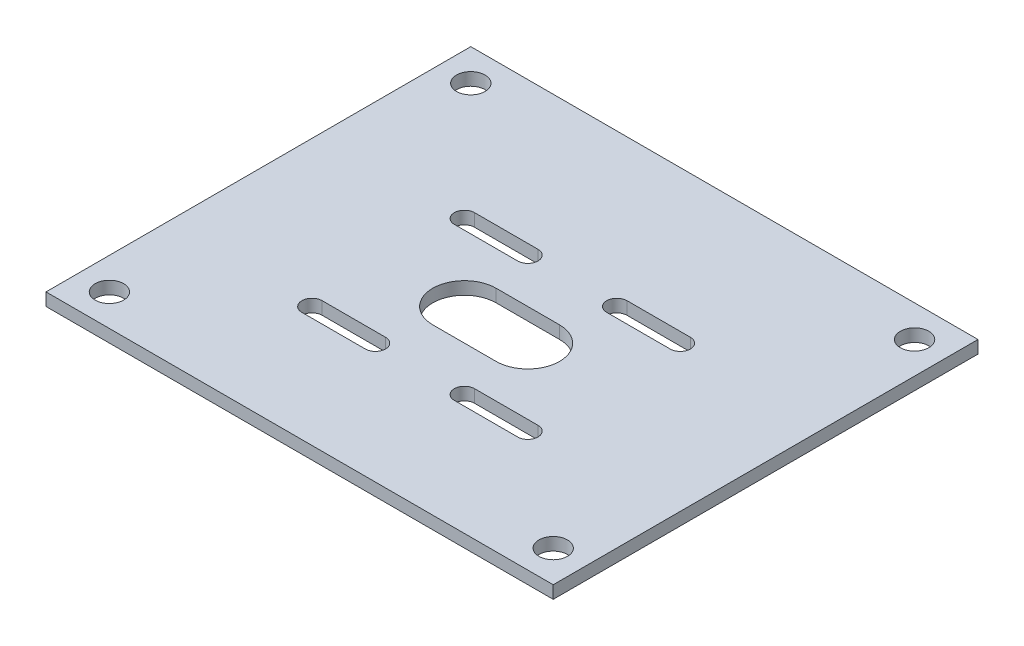
ISO-10303-21;
HEADER;
FILE_DESCRIPTION(('STEP AP214'),'2;1');
FILE_NAME('part.step','',(''),(''),'','','');
FILE_SCHEMA(('AUTOMOTIVE_DESIGN { 1 0 10303 214 1 1 1 1 }'));
ENDSEC;
DATA;
#1=APPLICATION_CONTEXT('core data for automotive mechanical design processes');
#2=APPLICATION_PROTOCOL_DEFINITION('international standard','automotive_design',2000,#1);
#3=PRODUCT_CONTEXT('',#1,'mechanical');
#4=PRODUCT('Part','Part','',(#3));
#5=PRODUCT_RELATED_PRODUCT_CATEGORY('part','',(#4));
#6=PRODUCT_DEFINITION_FORMATION('','',#4);
#7=PRODUCT_DEFINITION_CONTEXT('part definition',#1,'design');
#8=PRODUCT_DEFINITION('design','',#6,#7);
#9=PRODUCT_DEFINITION_SHAPE('','',#8);
#10=(LENGTH_UNIT() NAMED_UNIT(*) SI_UNIT(.MILLI.,.METRE.));
#11=(NAMED_UNIT(*) PLANE_ANGLE_UNIT() SI_UNIT($,.RADIAN.));
#12=(NAMED_UNIT(*) SI_UNIT($,.STERADIAN.) SOLID_ANGLE_UNIT());
#13=UNCERTAINTY_MEASURE_WITH_UNIT(LENGTH_MEASURE(1.E-05),#10,'distance_accuracy_value','');
#14=(GEOMETRIC_REPRESENTATION_CONTEXT(3) GLOBAL_UNCERTAINTY_ASSIGNED_CONTEXT((#13)) GLOBAL_UNIT_ASSIGNED_CONTEXT((#10,
#11,#12)) REPRESENTATION_CONTEXT('',''));
#15=CARTESIAN_POINT('',(0.,0.,0.));
#16=DIRECTION('',(0.,0.,1.));
#17=DIRECTION('',(1.,0.,0.));
#18=AXIS2_PLACEMENT_3D('',#15,#16,#17);
#19=CARTESIAN_POINT('',(0.,2.,0.));
#20=DIRECTION('',(0.,-1.,0.));
#21=DIRECTION('',(0.,0.,-1.));
#22=AXIS2_PLACEMENT_3D('',#19,#20,#21);
#23=PLANE('',#22);
#24=CARTESIAN_POINT('',(-22.0208152801713,2.,12.0208152801713));
#25=DIRECTION('',(0.,1.,0.));
#26=DIRECTION('',(0.,0.,-1.));
#27=AXIS2_PLACEMENT_3D('',#24,#25,#26);
#28=CIRCLE('',#27,1.6);
#29=CARTESIAN_POINT('',(-22.0208152801713,2.,10.4208152801713));
#30=VERTEX_POINT('',#29);
#31=CARTESIAN_POINT('',(-22.0208152801713,2.,13.6208152801713));
#32=VERTEX_POINT('',#31);
#33=EDGE_CURVE('E252',#30,#32,#28,.T.);
#34=ORIENTED_EDGE('',*,*,#33,.F.);
#35=DIRECTION('',(-1.,0.,0.));
#36=VECTOR('',#35,1.);
#37=CARTESIAN_POINT('',(-22.0208152801713,2.,10.4208152801713));
#38=LINE('',#37,#36);
#39=CARTESIAN_POINT('',(-12.0208152801713,2.,10.4208152801713));
#40=VERTEX_POINT('',#39);
#41=EDGE_CURVE('E263',#40,#30,#38,.T.);
#42=ORIENTED_EDGE('',*,*,#41,.F.);
#43=CARTESIAN_POINT('',(-12.0208152801713,2.,12.0208152801713));
#44=DIRECTION('',(0.,1.,0.));
#45=DIRECTION('',(0.,0.,-1.));
#46=AXIS2_PLACEMENT_3D('',#43,#44,#45);
#47=CIRCLE('',#46,1.6);
#48=CARTESIAN_POINT('',(-12.0208152801713,2.,13.6208152801713));
#49=VERTEX_POINT('',#48);
#50=EDGE_CURVE('E259',#49,#40,#47,.T.);
#51=ORIENTED_EDGE('',*,*,#50,.F.);
#52=DIRECTION('',(1.,0.,0.));
#53=VECTOR('',#52,1.);
#54=CARTESIAN_POINT('',(-22.0208152801713,2.,13.6208152801713));
#55=LINE('',#54,#53);
#56=EDGE_CURVE('E255',#32,#49,#55,.T.);
#57=ORIENTED_EDGE('',*,*,#56,.F.);
#58=EDGE_LOOP('',(#34,#42,#51,#57));
#59=FACE_BOUND('',#58,.T.);
#60=CARTESIAN_POINT('',(2.02081528017131,2.,-12.0208152801713));
#61=DIRECTION('',(0.,1.,0.));
#62=DIRECTION('',(0.,0.,1.));
#63=AXIS2_PLACEMENT_3D('',#60,#61,#62);
#64=CIRCLE('',#63,1.6);
#65=CARTESIAN_POINT('',(2.02081528017131,2.,-13.6208152801713));
#66=VERTEX_POINT('',#65);
#67=CARTESIAN_POINT('',(2.02081528017131,2.,-10.4208152801713));
#68=VERTEX_POINT('',#67);
#69=EDGE_CURVE('E338',#66,#68,#64,.T.);
#70=ORIENTED_EDGE('',*,*,#69,.F.);
#71=DIRECTION('',(-1.,0.,0.));
#72=VECTOR('',#71,1.);
#73=CARTESIAN_POINT('',(2.02081528017131,2.,-13.6208152801713));
#74=LINE('',#73,#72);
#75=CARTESIAN_POINT('',(12.0208152801713,2.,-13.6208152801713));
#76=VERTEX_POINT('',#75);
#77=EDGE_CURVE('E349',#76,#66,#74,.T.);
#78=ORIENTED_EDGE('',*,*,#77,.F.);
#79=CARTESIAN_POINT('',(12.0208152801713,2.,-12.0208152801713));
#80=DIRECTION('',(0.,1.,0.));
#81=DIRECTION('',(0.,0.,1.));
#82=AXIS2_PLACEMENT_3D('',#79,#80,#81);
#83=CIRCLE('',#82,1.6);
#84=CARTESIAN_POINT('',(12.0208152801713,2.,-10.4208152801713));
#85=VERTEX_POINT('',#84);
#86=EDGE_CURVE('E345',#85,#76,#83,.T.);
#87=ORIENTED_EDGE('',*,*,#86,.F.);
#88=DIRECTION('',(1.,0.,0.));
#89=VECTOR('',#88,1.);
#90=CARTESIAN_POINT('',(2.02081528017131,2.,-10.4208152801713));
#91=LINE('',#90,#89);
#92=EDGE_CURVE('E341',#68,#85,#91,.T.);
#93=ORIENTED_EDGE('',*,*,#92,.F.);
#94=EDGE_LOOP('',(#70,#78,#87,#93));
#95=FACE_BOUND('',#94,.T.);
#96=CARTESIAN_POINT('',(30.,2.,-31.));
#97=DIRECTION('',(0.,1.,0.));
#98=DIRECTION('',(0.,0.,1.));
#99=AXIS2_PLACEMENT_3D('',#96,#97,#98);
#100=CIRCLE('',#99,2.25);
#101=CARTESIAN_POINT('',(30.,2.,-28.75));
#102=VERTEX_POINT('',#101);
#103=EDGE_CURVE('E424',#102,#102,#100,.T.);
#104=ORIENTED_EDGE('',*,*,#103,.F.);
#105=EDGE_LOOP('',(#104));
#106=FACE_BOUND('',#105,.T.);
#107=CARTESIAN_POINT('',(-40.,2.,-31.));
#108=DIRECTION('',(0.,1.,0.));
#109=DIRECTION('',(0.,0.,1.));
#110=AXIS2_PLACEMENT_3D('',#107,#108,#109);
#111=CIRCLE('',#110,2.25);
#112=CARTESIAN_POINT('',(-40.,2.,-28.75));
#113=VERTEX_POINT('',#112);
#114=EDGE_CURVE('E432',#113,#113,#111,.T.);
#115=ORIENTED_EDGE('',*,*,#114,.F.);
#116=EDGE_LOOP('',(#115));
#117=FACE_BOUND('',#116,.T.);
#118=DIRECTION('',(0.,0.,1.));
#119=VECTOR('',#118,1.);
#120=CARTESIAN_POINT('',(-45.,2.,31.));
#121=LINE('',#120,#119);
#122=CARTESIAN_POINT('',(-45.,2.,-36.));
#123=VERTEX_POINT('',#122);
#124=CARTESIAN_POINT('',(-45.,2.,31.));
#125=VERTEX_POINT('',#124);
#126=EDGE_CURVE('E440',#123,#125,#121,.T.);
#127=ORIENTED_EDGE('',*,*,#126,.T.);
#128=DIRECTION('',(1.,0.,0.));
#129=VECTOR('',#128,1.);
#130=CARTESIAN_POINT('',(35.,2.,31.));
#131=LINE('',#130,#129);
#132=CARTESIAN_POINT('',(35.,2.,31.));
#133=VERTEX_POINT('',#132);
#134=EDGE_CURVE('E444',#125,#133,#131,.T.);
#135=ORIENTED_EDGE('',*,*,#134,.T.);
#136=DIRECTION('',(0.,0.,-1.));
#137=VECTOR('',#136,1.);
#138=CARTESIAN_POINT('',(35.,2.,-36.));
#139=LINE('',#138,#137);
#140=CARTESIAN_POINT('',(35.,2.,-36.));
#141=VERTEX_POINT('',#140);
#142=EDGE_CURVE('E448',#133,#141,#139,.T.);
#143=ORIENTED_EDGE('',*,*,#142,.T.);
#144=DIRECTION('',(-1.,0.,0.));
#145=VECTOR('',#144,1.);
#146=CARTESIAN_POINT('',(-45.,2.,-36.));
#147=LINE('',#146,#145);
#148=EDGE_CURVE('E451',#141,#123,#147,.T.);
#149=ORIENTED_EDGE('',*,*,#148,.T.);
#150=EDGE_LOOP('',(#127,#135,#143,#149));
#151=FACE_BOUND('',#150,.T.);
#152=CARTESIAN_POINT('',(-22.0208152801713,2.,-12.0208152801713));
#153=DIRECTION('',(0.,1.,0.));
#154=DIRECTION('',(0.,0.,1.));
#155=AXIS2_PLACEMENT_3D('',#152,#153,#154);
#156=CIRCLE('',#155,1.6);
#157=CARTESIAN_POINT('',(-22.0208152801713,2.,-13.6208152801713));
#158=VERTEX_POINT('',#157);
#159=CARTESIAN_POINT('',(-22.0208152801713,2.,-10.4208152801713));
#160=VERTEX_POINT('',#159);
#161=EDGE_CURVE('E381',#158,#160,#156,.T.);
#162=ORIENTED_EDGE('',*,*,#161,.F.);
#163=DIRECTION('',(-1.,0.,0.));
#164=VECTOR('',#163,1.);
#165=CARTESIAN_POINT('',(-22.0208152801713,2.,-13.6208152801713));
#166=LINE('',#165,#164);
#167=CARTESIAN_POINT('',(-12.0208152801713,2.,-13.6208152801713));
#168=VERTEX_POINT('',#167);
#169=EDGE_CURVE('E392',#168,#158,#166,.T.);
#170=ORIENTED_EDGE('',*,*,#169,.F.);
#171=CARTESIAN_POINT('',(-12.0208152801713,2.,-12.0208152801713));
#172=DIRECTION('',(0.,1.,0.));
#173=DIRECTION('',(0.,0.,1.));
#174=AXIS2_PLACEMENT_3D('',#171,#172,#173);
#175=CIRCLE('',#174,1.6);
#176=CARTESIAN_POINT('',(-12.0208152801713,2.,-10.4208152801713));
#177=VERTEX_POINT('',#176);
#178=EDGE_CURVE('E388',#177,#168,#175,.T.);
#179=ORIENTED_EDGE('',*,*,#178,.F.);
#180=DIRECTION('',(1.,0.,0.));
#181=VECTOR('',#180,1.);
#182=CARTESIAN_POINT('',(-22.0208152801713,2.,-10.4208152801713));
#183=LINE('',#182,#181);
#184=EDGE_CURVE('E384',#160,#177,#183,.T.);
#185=ORIENTED_EDGE('',*,*,#184,.F.);
#186=EDGE_LOOP('',(#162,#170,#179,#185));
#187=FACE_BOUND('',#186,.T.);
#188=CARTESIAN_POINT('',(-10.,2.,0.));
#189=DIRECTION('',(0.,1.,0.));
#190=DIRECTION('',(0.,0.,1.));
#191=AXIS2_PLACEMENT_3D('',#188,#189,#190);
#192=CIRCLE('',#191,5.);
#193=CARTESIAN_POINT('',(-10.,2.,-5.));
#194=VERTEX_POINT('',#193);
#195=CARTESIAN_POINT('',(-10.,2.,5.));
#196=VERTEX_POINT('',#195);
#197=EDGE_CURVE('E295',#194,#196,#192,.T.);
#198=ORIENTED_EDGE('',*,*,#197,.F.);
#199=DIRECTION('',(-1.,0.,0.));
#200=VECTOR('',#199,1.);
#201=CARTESIAN_POINT('',(-10.,2.,-5.));
#202=LINE('',#201,#200);
#203=CARTESIAN_POINT('',(0.,2.,-5.));
#204=VERTEX_POINT('',#203);
#205=EDGE_CURVE('E306',#204,#194,#202,.T.);
#206=ORIENTED_EDGE('',*,*,#205,.F.);
#207=CARTESIAN_POINT('',(0.,2.,0.));
#208=DIRECTION('',(0.,1.,0.));
#209=DIRECTION('',(0.,0.,1.));
#210=AXIS2_PLACEMENT_3D('',#207,#208,#209);
#211=CIRCLE('',#210,5.);
#212=CARTESIAN_POINT('',(0.,2.,5.));
#213=VERTEX_POINT('',#212);
#214=EDGE_CURVE('E302',#213,#204,#211,.T.);
#215=ORIENTED_EDGE('',*,*,#214,.F.);
#216=DIRECTION('',(1.,0.,0.));
#217=VECTOR('',#216,1.);
#218=CARTESIAN_POINT('',(-10.,2.,5.));
#219=LINE('',#218,#217);
#220=EDGE_CURVE('E298',#196,#213,#219,.T.);
#221=ORIENTED_EDGE('',*,*,#220,.F.);
#222=EDGE_LOOP('',(#198,#206,#215,#221));
#223=FACE_BOUND('',#222,.T.);
#224=CARTESIAN_POINT('',(2.02081528017131,2.,12.0208152801713));
#225=DIRECTION('',(0.,1.,0.));
#226=DIRECTION('',(0.,0.,-1.));
#227=AXIS2_PLACEMENT_3D('',#224,#225,#226);
#228=CIRCLE('',#227,1.6);
#229=CARTESIAN_POINT('',(2.02081528017131,2.,10.4208152801713));
#230=VERTEX_POINT('',#229);
#231=CARTESIAN_POINT('',(2.02081528017131,2.,13.6208152801713));
#232=VERTEX_POINT('',#231);
#233=EDGE_CURVE('E201',#230,#232,#228,.T.);
#234=ORIENTED_EDGE('',*,*,#233,.F.);
#235=DIRECTION('',(-1.,0.,0.));
#236=VECTOR('',#235,1.);
#237=CARTESIAN_POINT('',(2.02081528017131,2.,10.4208152801713));
#238=LINE('',#237,#236);
#239=CARTESIAN_POINT('',(12.0208152801713,2.,10.4208152801713));
#240=VERTEX_POINT('',#239);
#241=EDGE_CURVE('E228',#240,#230,#238,.T.);
#242=ORIENTED_EDGE('',*,*,#241,.F.);
#243=CARTESIAN_POINT('',(12.0208152801713,2.,12.0208152801713));
#244=DIRECTION('',(0.,1.,0.));
#245=DIRECTION('',(0.,0.,-1.));
#246=AXIS2_PLACEMENT_3D('',#243,#244,#245);
#247=CIRCLE('',#246,1.6);
#248=CARTESIAN_POINT('',(12.0208152801713,2.,13.6208152801713));
#249=VERTEX_POINT('',#248);
#250=EDGE_CURVE('E224',#249,#240,#247,.T.);
#251=ORIENTED_EDGE('',*,*,#250,.F.);
#252=DIRECTION('',(1.,0.,0.));
#253=VECTOR('',#252,1.);
#254=CARTESIAN_POINT('',(2.02081528017131,2.,13.6208152801713));
#255=LINE('',#254,#253);
#256=EDGE_CURVE('E210',#232,#249,#255,.T.);
#257=ORIENTED_EDGE('',*,*,#256,.F.);
#258=EDGE_LOOP('',(#234,#242,#251,#257));
#259=FACE_BOUND('',#258,.T.);
#260=CARTESIAN_POINT('',(30.,2.,26.));
#261=DIRECTION('',(0.,1.,0.));
#262=DIRECTION('',(0.,0.,-1.));
#263=AXIS2_PLACEMENT_3D('',#260,#261,#262);
#264=CIRCLE('',#263,2.25000000000001);
#265=CARTESIAN_POINT('',(30.,2.,23.75));
#266=VERTEX_POINT('',#265);
#267=EDGE_CURVE('E236',#266,#266,#264,.T.);
#268=ORIENTED_EDGE('',*,*,#267,.F.);
#269=EDGE_LOOP('',(#268));
#270=FACE_BOUND('',#269,.T.);
#271=CARTESIAN_POINT('',(-40.,2.,26.));
#272=DIRECTION('',(0.,1.,0.));
#273=DIRECTION('',(0.,0.,-1.));
#274=AXIS2_PLACEMENT_3D('',#271,#272,#273);
#275=CIRCLE('',#274,2.24999999999999);
#276=CARTESIAN_POINT('',(-40.,2.,23.75));
#277=VERTEX_POINT('',#276);
#278=EDGE_CURVE('E622',#277,#277,#275,.T.);
#279=ORIENTED_EDGE('',*,*,#278,.F.);
#280=EDGE_LOOP('',(#279));
#281=FACE_BOUND('',#280,.T.);
#282=ADVANCED_FACE('F39',(#59,#95,#106,#117,#151,#187,#223,#259,#270,#281),#23,.F.);
#283=CARTESIAN_POINT('',(0.,0.,0.));
#284=DIRECTION('',(0.,-1.,0.));
#285=DIRECTION('',(0.,0.,-1.));
#286=AXIS2_PLACEMENT_3D('',#283,#284,#285);
#287=PLANE('',#286);
#288=CARTESIAN_POINT('',(30.,0.,26.));
#289=DIRECTION('',(0.,1.,0.));
#290=DIRECTION('',(0.,0.,-1.));
#291=AXIS2_PLACEMENT_3D('',#288,#289,#290);
#292=CIRCLE('',#291,2.25000000000001);
#293=CARTESIAN_POINT('',(30.,0.,23.75));
#294=VERTEX_POINT('',#293);
#295=EDGE_CURVE('E630',#294,#294,#292,.T.);
#296=ORIENTED_EDGE('',*,*,#295,.T.);
#297=EDGE_LOOP('',(#296));
#298=FACE_BOUND('',#297,.T.);
#299=CARTESIAN_POINT('',(-40.,0.,-31.));
#300=DIRECTION('',(0.,1.,0.));
#301=DIRECTION('',(0.,0.,1.));
#302=AXIS2_PLACEMENT_3D('',#299,#300,#301);
#303=CIRCLE('',#302,2.25);
#304=CARTESIAN_POINT('',(-40.,0.,-28.75));
#305=VERTEX_POINT('',#304);
#306=EDGE_CURVE('E428',#305,#305,#303,.T.);
#307=ORIENTED_EDGE('',*,*,#306,.T.);
#308=EDGE_LOOP('',(#307));
#309=FACE_BOUND('',#308,.T.);
#310=DIRECTION('',(0.,0.,1.));
#311=VECTOR('',#310,1.);
#312=CARTESIAN_POINT('',(-45.,0.,31.));
#313=LINE('',#312,#311);
#314=CARTESIAN_POINT('',(-45.,0.,-36.));
#315=VERTEX_POINT('',#314);
#316=CARTESIAN_POINT('',(-45.,0.,31.));
#317=VERTEX_POINT('',#316);
#318=EDGE_CURVE('E436',#315,#317,#313,.T.);
#319=ORIENTED_EDGE('',*,*,#318,.F.);
#320=DIRECTION('',(-1.,0.,0.));
#321=VECTOR('',#320,1.);
#322=CARTESIAN_POINT('',(-45.,0.,-36.));
#323=LINE('',#322,#321);
#324=CARTESIAN_POINT('',(35.,0.,-36.));
#325=VERTEX_POINT('',#324);
#326=EDGE_CURVE('E445',#325,#315,#323,.T.);
#327=ORIENTED_EDGE('',*,*,#326,.F.);
#328=DIRECTION('',(0.,0.,-1.));
#329=VECTOR('',#328,1.);
#330=CARTESIAN_POINT('',(35.,0.,-36.));
#331=LINE('',#330,#329);
#332=CARTESIAN_POINT('',(35.,0.,31.));
#333=VERTEX_POINT('',#332);
#334=EDGE_CURVE('E461',#333,#325,#331,.T.);
#335=ORIENTED_EDGE('',*,*,#334,.F.);
#336=DIRECTION('',(1.,0.,0.));
#337=VECTOR('',#336,1.);
#338=CARTESIAN_POINT('',(35.,0.,31.));
#339=LINE('',#338,#337);
#340=EDGE_CURVE('E458',#317,#333,#339,.T.);
#341=ORIENTED_EDGE('',*,*,#340,.F.);
#342=EDGE_LOOP('',(#319,#327,#335,#341));
#343=FACE_BOUND('',#342,.T.);
#344=CARTESIAN_POINT('',(30.,0.,-31.));
#345=DIRECTION('',(0.,1.,0.));
#346=DIRECTION('',(0.,0.,1.));
#347=AXIS2_PLACEMENT_3D('',#344,#345,#346);
#348=CIRCLE('',#347,2.25);
#349=CARTESIAN_POINT('',(30.,0.,-28.75));
#350=VERTEX_POINT('',#349);
#351=EDGE_CURVE('E423',#350,#350,#348,.T.);
#352=ORIENTED_EDGE('',*,*,#351,.T.);
#353=EDGE_LOOP('',(#352));
#354=FACE_BOUND('',#353,.T.);
#355=DIRECTION('',(-1.,0.,0.));
#356=VECTOR('',#355,1.);
#357=CARTESIAN_POINT('',(-22.0208152801713,0.,-13.6208152801713));
#358=LINE('',#357,#356);
#359=CARTESIAN_POINT('',(-12.0208152801713,0.,-13.6208152801713));
#360=VERTEX_POINT('',#359);
#361=CARTESIAN_POINT('',(-22.0208152801713,0.,-13.6208152801713));
#362=VERTEX_POINT('',#361);
#363=EDGE_CURVE('E385',#360,#362,#358,.T.);
#364=ORIENTED_EDGE('',*,*,#363,.T.);
#365=CARTESIAN_POINT('',(-22.0208152801713,0.,-12.0208152801713));
#366=DIRECTION('',(0.,1.,0.));
#367=DIRECTION('',(0.,0.,1.));
#368=AXIS2_PLACEMENT_3D('',#365,#366,#367);
#369=CIRCLE('',#368,1.6);
#370=CARTESIAN_POINT('',(-22.0208152801713,0.,-10.4208152801713));
#371=VERTEX_POINT('',#370);
#372=EDGE_CURVE('E380',#362,#371,#369,.T.);
#373=ORIENTED_EDGE('',*,*,#372,.T.);
#374=DIRECTION('',(1.,0.,0.));
#375=VECTOR('',#374,1.);
#376=CARTESIAN_POINT('',(-22.0208152801713,0.,-10.4208152801713));
#377=LINE('',#376,#375);
#378=CARTESIAN_POINT('',(-12.0208152801713,0.,-10.4208152801713));
#379=VERTEX_POINT('',#378);
#380=EDGE_CURVE('E399',#371,#379,#377,.T.);
#381=ORIENTED_EDGE('',*,*,#380,.T.);
#382=CARTESIAN_POINT('',(-12.0208152801713,0.,-12.0208152801713));
#383=DIRECTION('',(0.,1.,0.));
#384=DIRECTION('',(0.,0.,1.));
#385=AXIS2_PLACEMENT_3D('',#382,#383,#384);
#386=CIRCLE('',#385,1.6);
#387=EDGE_CURVE('E403',#379,#360,#386,.T.);
#388=ORIENTED_EDGE('',*,*,#387,.T.);
#389=EDGE_LOOP('',(#364,#373,#381,#388));
#390=FACE_BOUND('',#389,.T.);
#391=DIRECTION('',(-1.,0.,0.));
#392=VECTOR('',#391,1.);
#393=CARTESIAN_POINT('',(2.02081528017131,0.,-13.6208152801713));
#394=LINE('',#393,#392);
#395=CARTESIAN_POINT('',(12.0208152801713,0.,-13.6208152801713));
#396=VERTEX_POINT('',#395);
#397=CARTESIAN_POINT('',(2.02081528017131,0.,-13.6208152801713));
#398=VERTEX_POINT('',#397);
#399=EDGE_CURVE('E342',#396,#398,#394,.T.);
#400=ORIENTED_EDGE('',*,*,#399,.T.);
#401=CARTESIAN_POINT('',(2.02081528017131,0.,-12.0208152801713));
#402=DIRECTION('',(0.,1.,0.));
#403=DIRECTION('',(0.,0.,1.));
#404=AXIS2_PLACEMENT_3D('',#401,#402,#403);
#405=CIRCLE('',#404,1.6);
#406=CARTESIAN_POINT('',(2.02081528017131,0.,-10.4208152801713));
#407=VERTEX_POINT('',#406);
#408=EDGE_CURVE('E337',#398,#407,#405,.T.);
#409=ORIENTED_EDGE('',*,*,#408,.T.);
#410=DIRECTION('',(1.,0.,0.));
#411=VECTOR('',#410,1.);
#412=CARTESIAN_POINT('',(2.02081528017131,0.,-10.4208152801713));
#413=LINE('',#412,#411);
#414=CARTESIAN_POINT('',(12.0208152801713,0.,-10.4208152801713));
#415=VERTEX_POINT('',#414);
#416=EDGE_CURVE('E356',#407,#415,#413,.T.);
#417=ORIENTED_EDGE('',*,*,#416,.T.);
#418=CARTESIAN_POINT('',(12.0208152801713,0.,-12.0208152801713));
#419=DIRECTION('',(0.,1.,0.));
#420=DIRECTION('',(0.,0.,1.));
#421=AXIS2_PLACEMENT_3D('',#418,#419,#420);
#422=CIRCLE('',#421,1.6);
#423=EDGE_CURVE('E360',#415,#396,#422,.T.);
#424=ORIENTED_EDGE('',*,*,#423,.T.);
#425=EDGE_LOOP('',(#400,#409,#417,#424));
#426=FACE_BOUND('',#425,.T.);
#427=DIRECTION('',(-1.,0.,0.));
#428=VECTOR('',#427,1.);
#429=CARTESIAN_POINT('',(-10.,0.,-5.));
#430=LINE('',#429,#428);
#431=CARTESIAN_POINT('',(0.,0.,-5.));
#432=VERTEX_POINT('',#431);
#433=CARTESIAN_POINT('',(-10.,0.,-5.));
#434=VERTEX_POINT('',#433);
#435=EDGE_CURVE('E299',#432,#434,#430,.T.);
#436=ORIENTED_EDGE('',*,*,#435,.T.);
#437=CARTESIAN_POINT('',(-10.,0.,0.));
#438=DIRECTION('',(0.,1.,0.));
#439=DIRECTION('',(0.,0.,1.));
#440=AXIS2_PLACEMENT_3D('',#437,#438,#439);
#441=CIRCLE('',#440,5.);
#442=CARTESIAN_POINT('',(-10.,0.,5.));
#443=VERTEX_POINT('',#442);
#444=EDGE_CURVE('E294',#434,#443,#441,.T.);
#445=ORIENTED_EDGE('',*,*,#444,.T.);
#446=DIRECTION('',(1.,0.,0.));
#447=VECTOR('',#446,1.);
#448=CARTESIAN_POINT('',(-10.,0.,5.));
#449=LINE('',#448,#447);
#450=CARTESIAN_POINT('',(0.,0.,5.));
#451=VERTEX_POINT('',#450);
#452=EDGE_CURVE('E313',#443,#451,#449,.T.);
#453=ORIENTED_EDGE('',*,*,#452,.T.);
#454=CARTESIAN_POINT('',(0.,0.,0.));
#455=DIRECTION('',(0.,1.,0.));
#456=DIRECTION('',(0.,0.,1.));
#457=AXIS2_PLACEMENT_3D('',#454,#455,#456);
#458=CIRCLE('',#457,5.);
#459=EDGE_CURVE('E317',#451,#432,#458,.T.);
#460=ORIENTED_EDGE('',*,*,#459,.T.);
#461=EDGE_LOOP('',(#436,#445,#453,#460));
#462=FACE_BOUND('',#461,.T.);
#463=DIRECTION('',(-1.,0.,0.));
#464=VECTOR('',#463,1.);
#465=CARTESIAN_POINT('',(-22.0208152801713,0.,10.4208152801713));
#466=LINE('',#465,#464);
#467=CARTESIAN_POINT('',(-12.0208152801713,0.,10.4208152801713));
#468=VERTEX_POINT('',#467);
#469=CARTESIAN_POINT('',(-22.0208152801713,0.,10.4208152801713));
#470=VERTEX_POINT('',#469);
#471=EDGE_CURVE('E256',#468,#470,#466,.T.);
#472=ORIENTED_EDGE('',*,*,#471,.T.);
#473=CARTESIAN_POINT('',(-22.0208152801713,0.,12.0208152801713));
#474=DIRECTION('',(0.,1.,0.));
#475=DIRECTION('',(0.,0.,-1.));
#476=AXIS2_PLACEMENT_3D('',#473,#474,#475);
#477=CIRCLE('',#476,1.6);
#478=CARTESIAN_POINT('',(-22.0208152801713,0.,13.6208152801713));
#479=VERTEX_POINT('',#478);
#480=EDGE_CURVE('E219',#470,#479,#477,.T.);
#481=ORIENTED_EDGE('',*,*,#480,.T.);
#482=DIRECTION('',(1.,0.,0.));
#483=VECTOR('',#482,1.);
#484=CARTESIAN_POINT('',(-22.0208152801713,0.,13.6208152801713));
#485=LINE('',#484,#483);
#486=CARTESIAN_POINT('',(-12.0208152801713,0.,13.6208152801713));
#487=VERTEX_POINT('',#486);
#488=EDGE_CURVE('E270',#479,#487,#485,.T.);
#489=ORIENTED_EDGE('',*,*,#488,.T.);
#490=CARTESIAN_POINT('',(-12.0208152801713,0.,12.0208152801713));
#491=DIRECTION('',(0.,1.,0.));
#492=DIRECTION('',(0.,0.,-1.));
#493=AXIS2_PLACEMENT_3D('',#490,#491,#492);
#494=CIRCLE('',#493,1.6);
#495=EDGE_CURVE('E274',#487,#468,#494,.T.);
#496=ORIENTED_EDGE('',*,*,#495,.T.);
#497=EDGE_LOOP('',(#472,#481,#489,#496));
#498=FACE_BOUND('',#497,.T.);
#499=DIRECTION('',(-1.,0.,0.));
#500=VECTOR('',#499,1.);
#501=CARTESIAN_POINT('',(2.02081528017131,0.,10.4208152801713));
#502=LINE('',#501,#500);
#503=CARTESIAN_POINT('',(12.0208152801713,0.,10.4208152801713));
#504=VERTEX_POINT('',#503);
#505=CARTESIAN_POINT('',(2.02081528017131,0.,10.4208152801713));
#506=VERTEX_POINT('',#505);
#507=EDGE_CURVE('E211',#504,#506,#502,.T.);
#508=ORIENTED_EDGE('',*,*,#507,.T.);
#509=CARTESIAN_POINT('',(2.02081528017131,0.,12.0208152801713));
#510=DIRECTION('',(0.,1.,0.));
#511=DIRECTION('',(0.,0.,-1.));
#512=AXIS2_PLACEMENT_3D('',#509,#510,#511);
#513=CIRCLE('',#512,1.6);
#514=CARTESIAN_POINT('',(2.02081528017131,0.,13.6208152801713));
#515=VERTEX_POINT('',#514);
#516=EDGE_CURVE('E63',#506,#515,#513,.T.);
#517=ORIENTED_EDGE('',*,*,#516,.T.);
#518=DIRECTION('',(1.,0.,0.));
#519=VECTOR('',#518,1.);
#520=CARTESIAN_POINT('',(2.02081528017131,0.,13.6208152801713));
#521=LINE('',#520,#519);
#522=CARTESIAN_POINT('',(12.0208152801713,0.,13.6208152801713));
#523=VERTEX_POINT('',#522);
#524=EDGE_CURVE('E217',#515,#523,#521,.T.);
#525=ORIENTED_EDGE('',*,*,#524,.T.);
#526=CARTESIAN_POINT('',(12.0208152801713,0.,12.0208152801713));
#527=DIRECTION('',(0.,1.,0.));
#528=DIRECTION('',(0.,0.,-1.));
#529=AXIS2_PLACEMENT_3D('',#526,#527,#528);
#530=CIRCLE('',#529,1.6);
#531=EDGE_CURVE('E239',#523,#504,#530,.T.);
#532=ORIENTED_EDGE('',*,*,#531,.T.);
#533=EDGE_LOOP('',(#508,#517,#525,#532));
#534=FACE_BOUND('',#533,.T.);
#535=CARTESIAN_POINT('',(-40.,0.,26.));
#536=DIRECTION('',(0.,1.,0.));
#537=DIRECTION('',(0.,0.,-1.));
#538=AXIS2_PLACEMENT_3D('',#535,#536,#537);
#539=CIRCLE('',#538,2.24999999999999);
#540=CARTESIAN_POINT('',(-40.,0.,23.75));
#541=VERTEX_POINT('',#540);
#542=EDGE_CURVE('E625',#541,#541,#539,.T.);
#543=ORIENTED_EDGE('',*,*,#542,.T.);
#544=EDGE_LOOP('',(#543));
#545=FACE_BOUND('',#544,.T.);
#546=ADVANCED_FACE('F484',(#298,#309,#343,#354,#390,#426,#462,#498,#534,#545),#287,.T.);
#547=CARTESIAN_POINT('',(-45.,2.,31.));
#548=DIRECTION('',(1.,0.,0.));
#549=DIRECTION('',(0.,0.,-1.));
#550=AXIS2_PLACEMENT_3D('',#547,#548,#549);
#551=PLANE('',#550);
#552=ORIENTED_EDGE('',*,*,#318,.T.);
#553=DIRECTION('',(0.,-1.,0.));
#554=VECTOR('',#553,1.);
#555=CARTESIAN_POINT('',(-45.,2.,31.));
#556=LINE('',#555,#554);
#557=EDGE_CURVE('E11',#125,#317,#556,.T.);
#558=ORIENTED_EDGE('',*,*,#557,.F.);
#559=ORIENTED_EDGE('',*,*,#126,.F.);
#560=DIRECTION('',(0.,-1.,0.));
#561=VECTOR('',#560,1.);
#562=CARTESIAN_POINT('',(-45.,2.,-36.));
#563=LINE('',#562,#561);
#564=EDGE_CURVE('E454',#123,#315,#563,.T.);
#565=ORIENTED_EDGE('',*,*,#564,.T.);
#566=EDGE_LOOP('',(#552,#558,#559,#565));
#567=FACE_BOUND('',#566,.T.);
#568=ADVANCED_FACE('F41',(#567),#551,.F.);
#569=CARTESIAN_POINT('',(35.,2.,31.));
#570=DIRECTION('',(0.,0.,-1.));
#571=DIRECTION('',(-1.,0.,0.));
#572=AXIS2_PLACEMENT_3D('',#569,#570,#571);
#573=PLANE('',#572);
#574=ORIENTED_EDGE('',*,*,#340,.T.);
#575=DIRECTION('',(0.,-1.,0.));
#576=VECTOR('',#575,1.);
#577=CARTESIAN_POINT('',(35.,2.,31.));
#578=LINE('',#577,#576);
#579=EDGE_CURVE('E48',#133,#333,#578,.T.);
#580=ORIENTED_EDGE('',*,*,#579,.F.);
#581=ORIENTED_EDGE('',*,*,#134,.F.);
#582=ORIENTED_EDGE('',*,*,#557,.T.);
#583=EDGE_LOOP('',(#574,#580,#581,#582));
#584=FACE_BOUND('',#583,.T.);
#585=ADVANCED_FACE('F495',(#584),#573,.F.);
#586=CARTESIAN_POINT('',(35.,2.,-36.));
#587=DIRECTION('',(-1.,0.,0.));
#588=DIRECTION('',(0.,0.,1.));
#589=AXIS2_PLACEMENT_3D('',#586,#587,#588);
#590=PLANE('',#589);
#591=ORIENTED_EDGE('',*,*,#334,.T.);
#592=DIRECTION('',(0.,-1.,0.));
#593=VECTOR('',#592,1.);
#594=CARTESIAN_POINT('',(35.,2.,-36.));
#595=LINE('',#594,#593);
#596=EDGE_CURVE('E469',#141,#325,#595,.T.);
#597=ORIENTED_EDGE('',*,*,#596,.F.);
#598=ORIENTED_EDGE('',*,*,#142,.F.);
#599=ORIENTED_EDGE('',*,*,#579,.T.);
#600=EDGE_LOOP('',(#591,#597,#598,#599));
#601=FACE_BOUND('',#600,.T.);
#602=ADVANCED_FACE('F478',(#601),#590,.F.);
#603=CARTESIAN_POINT('',(-45.,2.,-36.));
#604=DIRECTION('',(0.,0.,1.));
#605=DIRECTION('',(1.,0.,0.));
#606=AXIS2_PLACEMENT_3D('',#603,#604,#605);
#607=PLANE('',#606);
#608=ORIENTED_EDGE('',*,*,#326,.T.);
#609=ORIENTED_EDGE('',*,*,#564,.F.);
#610=ORIENTED_EDGE('',*,*,#148,.F.);
#611=ORIENTED_EDGE('',*,*,#596,.T.);
#612=EDGE_LOOP('',(#608,#609,#610,#611));
#613=FACE_BOUND('',#612,.T.);
#614=ADVANCED_FACE('F488',(#613),#607,.F.);
#615=CARTESIAN_POINT('',(-40.,2.,-31.));
#616=DIRECTION('',(0.,-1.,0.));
#617=DIRECTION('',(0.,0.,-1.));
#618=AXIS2_PLACEMENT_3D('',#615,#616,#617);
#619=CYLINDRICAL_SURFACE('',#618,2.25);
#620=ORIENTED_EDGE('',*,*,#114,.T.);
#621=EDGE_LOOP('',(#620));
#622=FACE_BOUND('',#621,.T.);
#623=ORIENTED_EDGE('',*,*,#306,.F.);
#624=EDGE_LOOP('',(#623));
#625=FACE_BOUND('',#624,.T.);
#626=ADVANCED_FACE('F513',(#622,#625),#619,.F.);
#627=CARTESIAN_POINT('',(30.,2.,-31.));
#628=DIRECTION('',(0.,-1.,0.));
#629=DIRECTION('',(0.,0.,-1.));
#630=AXIS2_PLACEMENT_3D('',#627,#628,#629);
#631=CYLINDRICAL_SURFACE('',#630,2.25);
#632=ORIENTED_EDGE('',*,*,#103,.T.);
#633=EDGE_LOOP('',(#632));
#634=FACE_BOUND('',#633,.T.);
#635=ORIENTED_EDGE('',*,*,#351,.F.);
#636=EDGE_LOOP('',(#635));
#637=FACE_BOUND('',#636,.T.);
#638=ADVANCED_FACE('F520',(#634,#637),#631,.F.);
#639=CARTESIAN_POINT('',(-22.0208152801713,2.,-12.0208152801713));
#640=DIRECTION('',(0.,-1.,0.));
#641=DIRECTION('',(0.,0.,-1.));
#642=AXIS2_PLACEMENT_3D('',#639,#640,#641);
#643=CYLINDRICAL_SURFACE('',#642,1.6);
#644=ORIENTED_EDGE('',*,*,#372,.F.);
#645=DIRECTION('',(0.,-1.,0.));
#646=VECTOR('',#645,1.);
#647=CARTESIAN_POINT('',(-22.0208152801713,2.,-13.6208152801713));
#648=LINE('',#647,#646);
#649=EDGE_CURVE('E395',#158,#362,#648,.T.);
#650=ORIENTED_EDGE('',*,*,#649,.F.);
#651=ORIENTED_EDGE('',*,*,#161,.T.);
#652=DIRECTION('',(0.,-1.,0.));
#653=VECTOR('',#652,1.);
#654=CARTESIAN_POINT('',(-22.0208152801713,2.,-10.4208152801713));
#655=LINE('',#654,#653);
#656=EDGE_CURVE('E419',#160,#371,#655,.T.);
#657=ORIENTED_EDGE('',*,*,#656,.T.);
#658=EDGE_LOOP('',(#644,#650,#651,#657));
#659=FACE_BOUND('',#658,.T.);
#660=ADVANCED_FACE('F525',(#659),#643,.F.);
#661=CARTESIAN_POINT('',(-22.0208152801713,2.,-10.4208152801713));
#662=DIRECTION('',(0.,0.,-1.));
#663=DIRECTION('',(-1.,0.,0.));
#664=AXIS2_PLACEMENT_3D('',#661,#662,#663);
#665=PLANE('',#664);
#666=ORIENTED_EDGE('',*,*,#380,.F.);
#667=ORIENTED_EDGE('',*,*,#656,.F.);
#668=ORIENTED_EDGE('',*,*,#184,.T.);
#669=DIRECTION('',(0.,-1.,0.));
#670=VECTOR('',#669,1.);
#671=CARTESIAN_POINT('',(-12.0208152801713,2.,-10.4208152801713));
#672=LINE('',#671,#670);
#673=EDGE_CURVE('E416',#177,#379,#672,.T.);
#674=ORIENTED_EDGE('',*,*,#673,.T.);
#675=EDGE_LOOP('',(#666,#667,#668,#674));
#676=FACE_BOUND('',#675,.T.);
#677=ADVANCED_FACE('F535',(#676),#665,.T.);
#678=CARTESIAN_POINT('',(-12.0208152801713,2.,-12.0208152801713));
#679=DIRECTION('',(0.,-1.,0.));
#680=DIRECTION('',(0.,0.,-1.));
#681=AXIS2_PLACEMENT_3D('',#678,#679,#680);
#682=CYLINDRICAL_SURFACE('',#681,1.6);
#683=ORIENTED_EDGE('',*,*,#387,.F.);
#684=ORIENTED_EDGE('',*,*,#673,.F.);
#685=ORIENTED_EDGE('',*,*,#178,.T.);
#686=DIRECTION('',(0.,-1.,0.));
#687=VECTOR('',#686,1.);
#688=CARTESIAN_POINT('',(-12.0208152801713,2.,-13.6208152801713));
#689=LINE('',#688,#687);
#690=EDGE_CURVE('E413',#168,#360,#689,.T.);
#691=ORIENTED_EDGE('',*,*,#690,.T.);
#692=EDGE_LOOP('',(#683,#684,#685,#691));
#693=FACE_BOUND('',#692,.T.);
#694=ADVANCED_FACE('F542',(#693),#682,.F.);
#695=CARTESIAN_POINT('',(-22.0208152801713,2.,-13.6208152801713));
#696=DIRECTION('',(0.,0.,1.));
#697=DIRECTION('',(1.,0.,0.));
#698=AXIS2_PLACEMENT_3D('',#695,#696,#697);
#699=PLANE('',#698);
#700=ORIENTED_EDGE('',*,*,#363,.F.);
#701=ORIENTED_EDGE('',*,*,#690,.F.);
#702=ORIENTED_EDGE('',*,*,#169,.T.);
#703=ORIENTED_EDGE('',*,*,#649,.T.);
#704=EDGE_LOOP('',(#700,#701,#702,#703));
#705=FACE_BOUND('',#704,.T.);
#706=ADVANCED_FACE('F546',(#705),#699,.T.);
#707=CARTESIAN_POINT('',(2.02081528017131,2.,-12.0208152801713));
#708=DIRECTION('',(0.,-1.,0.));
#709=DIRECTION('',(0.,0.,-1.));
#710=AXIS2_PLACEMENT_3D('',#707,#708,#709);
#711=CYLINDRICAL_SURFACE('',#710,1.6);
#712=ORIENTED_EDGE('',*,*,#408,.F.);
#713=DIRECTION('',(0.,-1.,0.));
#714=VECTOR('',#713,1.);
#715=CARTESIAN_POINT('',(2.02081528017131,2.,-13.6208152801713));
#716=LINE('',#715,#714);
#717=EDGE_CURVE('E352',#66,#398,#716,.T.);
#718=ORIENTED_EDGE('',*,*,#717,.F.);
#719=ORIENTED_EDGE('',*,*,#69,.T.);
#720=DIRECTION('',(0.,-1.,0.));
#721=VECTOR('',#720,1.);
#722=CARTESIAN_POINT('',(2.02081528017131,2.,-10.4208152801713));
#723=LINE('',#722,#721);
#724=EDGE_CURVE('E376',#68,#407,#723,.T.);
#725=ORIENTED_EDGE('',*,*,#724,.T.);
#726=EDGE_LOOP('',(#712,#718,#719,#725));
#727=FACE_BOUND('',#726,.T.);
#728=ADVANCED_FACE('F550',(#727),#711,.F.);
#729=CARTESIAN_POINT('',(2.02081528017131,2.,-10.4208152801713));
#730=DIRECTION('',(0.,0.,-1.));
#731=DIRECTION('',(-1.,0.,0.));
#732=AXIS2_PLACEMENT_3D('',#729,#730,#731);
#733=PLANE('',#732);
#734=ORIENTED_EDGE('',*,*,#416,.F.);
#735=ORIENTED_EDGE('',*,*,#724,.F.);
#736=ORIENTED_EDGE('',*,*,#92,.T.);
#737=DIRECTION('',(0.,-1.,0.));
#738=VECTOR('',#737,1.);
#739=CARTESIAN_POINT('',(12.0208152801713,2.,-10.4208152801713));
#740=LINE('',#739,#738);
#741=EDGE_CURVE('E373',#85,#415,#740,.T.);
#742=ORIENTED_EDGE('',*,*,#741,.T.);
#743=EDGE_LOOP('',(#734,#735,#736,#742));
#744=FACE_BOUND('',#743,.T.);
#745=ADVANCED_FACE('F554',(#744),#733,.T.);
#746=CARTESIAN_POINT('',(12.0208152801713,2.,-12.0208152801713));
#747=DIRECTION('',(0.,-1.,0.));
#748=DIRECTION('',(0.,0.,-1.));
#749=AXIS2_PLACEMENT_3D('',#746,#747,#748);
#750=CYLINDRICAL_SURFACE('',#749,1.6);
#751=ORIENTED_EDGE('',*,*,#423,.F.);
#752=ORIENTED_EDGE('',*,*,#741,.F.);
#753=ORIENTED_EDGE('',*,*,#86,.T.);
#754=DIRECTION('',(0.,-1.,0.));
#755=VECTOR('',#754,1.);
#756=CARTESIAN_POINT('',(12.0208152801713,2.,-13.6208152801713));
#757=LINE('',#756,#755);
#758=EDGE_CURVE('E370',#76,#396,#757,.T.);
#759=ORIENTED_EDGE('',*,*,#758,.T.);
#760=EDGE_LOOP('',(#751,#752,#753,#759));
#761=FACE_BOUND('',#760,.T.);
#762=ADVANCED_FACE('F558',(#761),#750,.F.);
#763=CARTESIAN_POINT('',(2.02081528017131,2.,-13.6208152801713));
#764=DIRECTION('',(0.,0.,1.));
#765=DIRECTION('',(1.,0.,0.));
#766=AXIS2_PLACEMENT_3D('',#763,#764,#765);
#767=PLANE('',#766);
#768=ORIENTED_EDGE('',*,*,#399,.F.);
#769=ORIENTED_EDGE('',*,*,#758,.F.);
#770=ORIENTED_EDGE('',*,*,#77,.T.);
#771=ORIENTED_EDGE('',*,*,#717,.T.);
#772=EDGE_LOOP('',(#768,#769,#770,#771));
#773=FACE_BOUND('',#772,.T.);
#774=ADVANCED_FACE('F562',(#773),#767,.T.);
#775=CARTESIAN_POINT('',(-10.,2.,0.));
#776=DIRECTION('',(0.,-1.,0.));
#777=DIRECTION('',(0.,0.,-1.));
#778=AXIS2_PLACEMENT_3D('',#775,#776,#777);
#779=CYLINDRICAL_SURFACE('',#778,5.);
#780=ORIENTED_EDGE('',*,*,#444,.F.);
#781=DIRECTION('',(0.,-1.,0.));
#782=VECTOR('',#781,1.);
#783=CARTESIAN_POINT('',(-10.,2.,-5.));
#784=LINE('',#783,#782);
#785=EDGE_CURVE('E309',#194,#434,#784,.T.);
#786=ORIENTED_EDGE('',*,*,#785,.F.);
#787=ORIENTED_EDGE('',*,*,#197,.T.);
#788=DIRECTION('',(0.,-1.,0.));
#789=VECTOR('',#788,1.);
#790=CARTESIAN_POINT('',(-10.,2.,5.));
#791=LINE('',#790,#789);
#792=EDGE_CURVE('E333',#196,#443,#791,.T.);
#793=ORIENTED_EDGE('',*,*,#792,.T.);
#794=EDGE_LOOP('',(#780,#786,#787,#793));
#795=FACE_BOUND('',#794,.T.);
#796=ADVANCED_FACE('F566',(#795),#779,.F.);
#797=CARTESIAN_POINT('',(-10.,2.,5.));
#798=DIRECTION('',(0.,0.,-1.));
#799=DIRECTION('',(-1.,0.,0.));
#800=AXIS2_PLACEMENT_3D('',#797,#798,#799);
#801=PLANE('',#800);
#802=ORIENTED_EDGE('',*,*,#452,.F.);
#803=ORIENTED_EDGE('',*,*,#792,.F.);
#804=ORIENTED_EDGE('',*,*,#220,.T.);
#805=DIRECTION('',(0.,-1.,0.));
#806=VECTOR('',#805,1.);
#807=CARTESIAN_POINT('',(0.,2.,5.));
#808=LINE('',#807,#806);
#809=EDGE_CURVE('E330',#213,#451,#808,.T.);
#810=ORIENTED_EDGE('',*,*,#809,.T.);
#811=EDGE_LOOP('',(#802,#803,#804,#810));
#812=FACE_BOUND('',#811,.T.);
#813=ADVANCED_FACE('F570',(#812),#801,.T.);
#814=CARTESIAN_POINT('',(0.,2.,0.));
#815=DIRECTION('',(0.,-1.,0.));
#816=DIRECTION('',(0.,0.,-1.));
#817=AXIS2_PLACEMENT_3D('',#814,#815,#816);
#818=CYLINDRICAL_SURFACE('',#817,5.);
#819=ORIENTED_EDGE('',*,*,#459,.F.);
#820=ORIENTED_EDGE('',*,*,#809,.F.);
#821=ORIENTED_EDGE('',*,*,#214,.T.);
#822=DIRECTION('',(0.,-1.,0.));
#823=VECTOR('',#822,1.);
#824=CARTESIAN_POINT('',(0.,2.,-5.));
#825=LINE('',#824,#823);
#826=EDGE_CURVE('E327',#204,#432,#825,.T.);
#827=ORIENTED_EDGE('',*,*,#826,.T.);
#828=EDGE_LOOP('',(#819,#820,#821,#827));
#829=FACE_BOUND('',#828,.T.);
#830=ADVANCED_FACE('F574',(#829),#818,.F.);
#831=CARTESIAN_POINT('',(-10.,2.,-5.));
#832=DIRECTION('',(0.,0.,1.));
#833=DIRECTION('',(1.,0.,0.));
#834=AXIS2_PLACEMENT_3D('',#831,#832,#833);
#835=PLANE('',#834);
#836=ORIENTED_EDGE('',*,*,#435,.F.);
#837=ORIENTED_EDGE('',*,*,#826,.F.);
#838=ORIENTED_EDGE('',*,*,#205,.T.);
#839=ORIENTED_EDGE('',*,*,#785,.T.);
#840=EDGE_LOOP('',(#836,#837,#838,#839));
#841=FACE_BOUND('',#840,.T.);
#842=ADVANCED_FACE('F578',(#841),#835,.T.);
#843=CARTESIAN_POINT('',(-22.0208152801713,2.,12.0208152801713));
#844=DIRECTION('',(0.,-1.,0.));
#845=DIRECTION('',(0.,0.,-1.));
#846=AXIS2_PLACEMENT_3D('',#843,#844,#845);
#847=CYLINDRICAL_SURFACE('',#846,1.6);
#848=ORIENTED_EDGE('',*,*,#480,.F.);
#849=DIRECTION('',(0.,-1.,0.));
#850=VECTOR('',#849,1.);
#851=CARTESIAN_POINT('',(-22.0208152801713,2.,10.4208152801713));
#852=LINE('',#851,#850);
#853=EDGE_CURVE('E266',#30,#470,#852,.T.);
#854=ORIENTED_EDGE('',*,*,#853,.F.);
#855=ORIENTED_EDGE('',*,*,#33,.T.);
#856=DIRECTION('',(0.,-1.,0.));
#857=VECTOR('',#856,1.);
#858=CARTESIAN_POINT('',(-22.0208152801713,2.,13.6208152801713));
#859=LINE('',#858,#857);
#860=EDGE_CURVE('E290',#32,#479,#859,.T.);
#861=ORIENTED_EDGE('',*,*,#860,.T.);
#862=EDGE_LOOP('',(#848,#854,#855,#861));
#863=FACE_BOUND('',#862,.T.);
#864=ADVANCED_FACE('F582',(#863),#847,.F.);
#865=CARTESIAN_POINT('',(-22.0208152801713,2.,13.6208152801713));
#866=DIRECTION('',(0.,0.,-1.));
#867=DIRECTION('',(-1.,0.,0.));
#868=AXIS2_PLACEMENT_3D('',#865,#866,#867);
#869=PLANE('',#868);
#870=ORIENTED_EDGE('',*,*,#488,.F.);
#871=ORIENTED_EDGE('',*,*,#860,.F.);
#872=ORIENTED_EDGE('',*,*,#56,.T.);
#873=DIRECTION('',(0.,-1.,0.));
#874=VECTOR('',#873,1.);
#875=CARTESIAN_POINT('',(-12.0208152801713,2.,13.6208152801713));
#876=LINE('',#875,#874);
#877=EDGE_CURVE('E287',#49,#487,#876,.T.);
#878=ORIENTED_EDGE('',*,*,#877,.T.);
#879=EDGE_LOOP('',(#870,#871,#872,#878));
#880=FACE_BOUND('',#879,.T.);
#881=ADVANCED_FACE('F586',(#880),#869,.T.);
#882=CARTESIAN_POINT('',(-12.0208152801713,2.,12.0208152801713));
#883=DIRECTION('',(0.,-1.,0.));
#884=DIRECTION('',(0.,0.,-1.));
#885=AXIS2_PLACEMENT_3D('',#882,#883,#884);
#886=CYLINDRICAL_SURFACE('',#885,1.6);
#887=ORIENTED_EDGE('',*,*,#495,.F.);
#888=ORIENTED_EDGE('',*,*,#877,.F.);
#889=ORIENTED_EDGE('',*,*,#50,.T.);
#890=DIRECTION('',(0.,-1.,0.));
#891=VECTOR('',#890,1.);
#892=CARTESIAN_POINT('',(-12.0208152801713,2.,10.4208152801713));
#893=LINE('',#892,#891);
#894=EDGE_CURVE('E284',#40,#468,#893,.T.);
#895=ORIENTED_EDGE('',*,*,#894,.T.);
#896=EDGE_LOOP('',(#887,#888,#889,#895));
#897=FACE_BOUND('',#896,.T.);
#898=ADVANCED_FACE('F590',(#897),#886,.F.);
#899=CARTESIAN_POINT('',(-22.0208152801713,2.,10.4208152801713));
#900=DIRECTION('',(0.,0.,1.));
#901=DIRECTION('',(1.,0.,0.));
#902=AXIS2_PLACEMENT_3D('',#899,#900,#901);
#903=PLANE('',#902);
#904=ORIENTED_EDGE('',*,*,#471,.F.);
#905=ORIENTED_EDGE('',*,*,#894,.F.);
#906=ORIENTED_EDGE('',*,*,#41,.T.);
#907=ORIENTED_EDGE('',*,*,#853,.T.);
#908=EDGE_LOOP('',(#904,#905,#906,#907));
#909=FACE_BOUND('',#908,.T.);
#910=ADVANCED_FACE('F594',(#909),#903,.T.);
#911=CARTESIAN_POINT('',(2.02081528017131,2.,12.0208152801713));
#912=DIRECTION('',(0.,-1.,0.));
#913=DIRECTION('',(0.,0.,-1.));
#914=AXIS2_PLACEMENT_3D('',#911,#912,#913);
#915=CYLINDRICAL_SURFACE('',#914,1.6);
#916=ORIENTED_EDGE('',*,*,#516,.F.);
#917=DIRECTION('',(0.,-1.,0.));
#918=VECTOR('',#917,1.);
#919=CARTESIAN_POINT('',(2.02081528017131,2.,10.4208152801713));
#920=LINE('',#919,#918);
#921=EDGE_CURVE('E205',#230,#506,#920,.T.);
#922=ORIENTED_EDGE('',*,*,#921,.F.);
#923=ORIENTED_EDGE('',*,*,#233,.T.);
#924=DIRECTION('',(0.,-1.,0.));
#925=VECTOR('',#924,1.);
#926=CARTESIAN_POINT('',(2.02081528017131,2.,13.6208152801713));
#927=LINE('',#926,#925);
#928=EDGE_CURVE('E204',#232,#515,#927,.T.);
#929=ORIENTED_EDGE('',*,*,#928,.T.);
#930=EDGE_LOOP('',(#916,#922,#923,#929));
#931=FACE_BOUND('',#930,.T.);
#932=ADVANCED_FACE('F203',(#931),#915,.F.);
#933=CARTESIAN_POINT('',(2.02081528017131,2.,13.6208152801713));
#934=DIRECTION('',(0.,0.,-1.));
#935=DIRECTION('',(-1.,0.,0.));
#936=AXIS2_PLACEMENT_3D('',#933,#934,#935);
#937=PLANE('',#936);
#938=ORIENTED_EDGE('',*,*,#524,.F.);
#939=ORIENTED_EDGE('',*,*,#928,.F.);
#940=ORIENTED_EDGE('',*,*,#256,.T.);
#941=DIRECTION('',(0.,-1.,0.));
#942=VECTOR('',#941,1.);
#943=CARTESIAN_POINT('',(12.0208152801713,2.,13.6208152801713));
#944=LINE('',#943,#942);
#945=EDGE_CURVE('E220',#249,#523,#944,.T.);
#946=ORIENTED_EDGE('',*,*,#945,.T.);
#947=EDGE_LOOP('',(#938,#939,#940,#946));
#948=FACE_BOUND('',#947,.T.);
#949=ADVANCED_FACE('F214',(#948),#937,.T.);
#950=CARTESIAN_POINT('',(12.0208152801713,2.,12.0208152801713));
#951=DIRECTION('',(0.,-1.,0.));
#952=DIRECTION('',(0.,0.,-1.));
#953=AXIS2_PLACEMENT_3D('',#950,#951,#952);
#954=CYLINDRICAL_SURFACE('',#953,1.6);
#955=ORIENTED_EDGE('',*,*,#531,.F.);
#956=ORIENTED_EDGE('',*,*,#945,.F.);
#957=ORIENTED_EDGE('',*,*,#250,.T.);
#958=DIRECTION('',(0.,-1.,0.));
#959=VECTOR('',#958,1.);
#960=CARTESIAN_POINT('',(12.0208152801713,2.,10.4208152801713));
#961=LINE('',#960,#959);
#962=EDGE_CURVE('E55',#240,#504,#961,.T.);
#963=ORIENTED_EDGE('',*,*,#962,.T.);
#964=EDGE_LOOP('',(#955,#956,#957,#963));
#965=FACE_BOUND('',#964,.T.);
#966=ADVANCED_FACE('F603',(#965),#954,.F.);
#967=CARTESIAN_POINT('',(2.02081528017131,2.,10.4208152801713));
#968=DIRECTION('',(0.,0.,1.));
#969=DIRECTION('',(1.,0.,0.));
#970=AXIS2_PLACEMENT_3D('',#967,#968,#969);
#971=PLANE('',#970);
#972=ORIENTED_EDGE('',*,*,#507,.F.);
#973=ORIENTED_EDGE('',*,*,#962,.F.);
#974=ORIENTED_EDGE('',*,*,#241,.T.);
#975=ORIENTED_EDGE('',*,*,#921,.T.);
#976=EDGE_LOOP('',(#972,#973,#974,#975));
#977=FACE_BOUND('',#976,.T.);
#978=ADVANCED_FACE('F606',(#977),#971,.T.);
#979=CARTESIAN_POINT('',(30.,2.,26.));
#980=DIRECTION('',(0.,-1.,0.));
#981=DIRECTION('',(0.,0.,-1.));
#982=AXIS2_PLACEMENT_3D('',#979,#980,#981);
#983=CYLINDRICAL_SURFACE('',#982,2.25000000000001);
#984=ORIENTED_EDGE('',*,*,#267,.T.);
#985=EDGE_LOOP('',(#984));
#986=FACE_BOUND('',#985,.T.);
#987=ORIENTED_EDGE('',*,*,#295,.F.);
#988=EDGE_LOOP('',(#987));
#989=FACE_BOUND('',#988,.T.);
#990=ADVANCED_FACE('F610',(#986,#989),#983,.F.);
#991=CARTESIAN_POINT('',(-40.,2.,26.));
#992=DIRECTION('',(0.,-1.,0.));
#993=DIRECTION('',(0.,0.,-1.));
#994=AXIS2_PLACEMENT_3D('',#991,#992,#993);
#995=CYLINDRICAL_SURFACE('',#994,2.24999999999999);
#996=ORIENTED_EDGE('',*,*,#278,.T.);
#997=EDGE_LOOP('',(#996));
#998=FACE_BOUND('',#997,.T.);
#999=ORIENTED_EDGE('',*,*,#542,.F.);
#1000=EDGE_LOOP('',(#999));
#1001=FACE_BOUND('',#1000,.T.);
#1002=ADVANCED_FACE('F613',(#998,#1001),#995,.F.);
#1003=CLOSED_SHELL('',(#282,#546,#568,#585,#602,#614,#626,#638,#660,#677,#694,#706,#728,#745,
#762,#774,#796,#813,#830,#842,#864,#881,#898,#910,#932,#949,#966,#978,#990,#1002));
#1004=MANIFOLD_SOLID_BREP('B2',#1003);
#1005=ADVANCED_BREP_SHAPE_REPRESENTATION('',(#18,#1004),#14);
#1006=SHAPE_DEFINITION_REPRESENTATION(#9,#1005);
ENDSEC;
END-ISO-10303-21;
